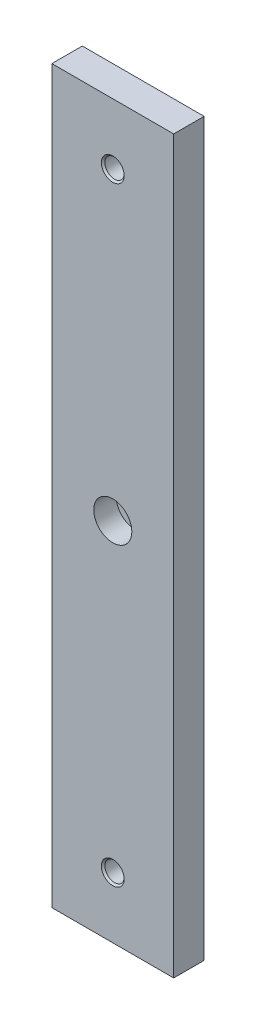
ISO-10303-21;
HEADER;
FILE_DESCRIPTION(('STEP AP214'),'2;1');
FILE_NAME('part.step','',(''),(''),'','','');
FILE_SCHEMA(('AUTOMOTIVE_DESIGN { 1 0 10303 214 1 1 1 1 }'));
ENDSEC;
DATA;
#1=APPLICATION_CONTEXT('core data for automotive mechanical design processes');
#2=APPLICATION_PROTOCOL_DEFINITION('international standard','automotive_design',2000,#1);
#3=PRODUCT_CONTEXT('',#1,'mechanical');
#4=PRODUCT('Part','Part','',(#3));
#5=PRODUCT_RELATED_PRODUCT_CATEGORY('part','',(#4));
#6=PRODUCT_DEFINITION_FORMATION('','',#4);
#7=PRODUCT_DEFINITION_CONTEXT('part definition',#1,'design');
#8=PRODUCT_DEFINITION('design','',#6,#7);
#9=PRODUCT_DEFINITION_SHAPE('','',#8);
#10=(LENGTH_UNIT() NAMED_UNIT(*) SI_UNIT(.MILLI.,.METRE.));
#11=(NAMED_UNIT(*) PLANE_ANGLE_UNIT() SI_UNIT($,.RADIAN.));
#12=(NAMED_UNIT(*) SI_UNIT($,.STERADIAN.) SOLID_ANGLE_UNIT());
#13=UNCERTAINTY_MEASURE_WITH_UNIT(LENGTH_MEASURE(1.E-05),#10,'distance_accuracy_value','');
#14=(GEOMETRIC_REPRESENTATION_CONTEXT(3) GLOBAL_UNCERTAINTY_ASSIGNED_CONTEXT((#13)) GLOBAL_UNIT_ASSIGNED_CONTEXT((#10,
#11,#12)) REPRESENTATION_CONTEXT('',''));
#15=CARTESIAN_POINT('',(0.,0.,0.));
#16=DIRECTION('',(0.,0.,1.));
#17=DIRECTION('',(1.,0.,0.));
#18=AXIS2_PLACEMENT_3D('',#15,#16,#17);
#19=CARTESIAN_POINT('',(-25.4,152.4,6.35));
#20=DIRECTION('',(1.,0.,0.));
#21=DIRECTION('',(0.,1.,0.));
#22=AXIS2_PLACEMENT_3D('',#19,#20,#21);
#23=PLANE('',#22);
#24=DIRECTION('',(0.,-1.,0.));
#25=VECTOR('',#24,1.);
#26=CARTESIAN_POINT('',(-25.4,152.4,-6.35));
#27=LINE('',#26,#25);
#28=CARTESIAN_POINT('',(-25.4,152.4,-6.35));
#29=VERTEX_POINT('',#28);
#30=CARTESIAN_POINT('',(-25.4,-152.4,-6.35));
#31=VERTEX_POINT('',#30);
#32=EDGE_CURVE('E123',#29,#31,#27,.T.);
#33=ORIENTED_EDGE('',*,*,#32,.T.);
#34=DIRECTION('',(0.,0.,-1.));
#35=VECTOR('',#34,1.);
#36=CARTESIAN_POINT('',(-25.4,-152.4,6.35));
#37=LINE('',#36,#35);
#38=CARTESIAN_POINT('',(-25.4,-152.4,6.35));
#39=VERTEX_POINT('',#38);
#40=EDGE_CURVE('E13',#39,#31,#37,.T.);
#41=ORIENTED_EDGE('',*,*,#40,.F.);
#42=DIRECTION('',(0.,-1.,0.));
#43=VECTOR('',#42,1.);
#44=CARTESIAN_POINT('',(-25.4,152.4,6.35));
#45=LINE('',#44,#43);
#46=CARTESIAN_POINT('',(-25.4,152.4,6.35));
#47=VERTEX_POINT('',#46);
#48=EDGE_CURVE('E106',#47,#39,#45,.T.);
#49=ORIENTED_EDGE('',*,*,#48,.F.);
#50=DIRECTION('',(0.,0.,-1.));
#51=VECTOR('',#50,1.);
#52=CARTESIAN_POINT('',(-25.4,152.4,6.35));
#53=LINE('',#52,#51);
#54=EDGE_CURVE('E119',#47,#29,#53,.T.);
#55=ORIENTED_EDGE('',*,*,#54,.T.);
#56=EDGE_LOOP('',(#33,#41,#49,#55));
#57=FACE_BOUND('',#56,.T.);
#58=ADVANCED_FACE('F54',(#57),#23,.F.);
#59=CARTESIAN_POINT('',(-25.4,-152.4,6.35));
#60=DIRECTION('',(0.,1.,0.));
#61=DIRECTION('',(0.,0.,1.));
#62=AXIS2_PLACEMENT_3D('',#59,#60,#61);
#63=PLANE('',#62);
#64=DIRECTION('',(1.,0.,0.));
#65=VECTOR('',#64,1.);
#66=CARTESIAN_POINT('',(-25.4,-152.4,-6.35));
#67=LINE('',#66,#65);
#68=CARTESIAN_POINT('',(25.4,-152.4,-6.35));
#69=VERTEX_POINT('',#68);
#70=EDGE_CURVE('E111',#31,#69,#67,.T.);
#71=ORIENTED_EDGE('',*,*,#70,.T.);
#72=DIRECTION('',(0.,0.,-1.));
#73=VECTOR('',#72,1.);
#74=CARTESIAN_POINT('',(25.4,-152.4,6.35));
#75=LINE('',#74,#73);
#76=CARTESIAN_POINT('',(25.4,-152.4,6.35));
#77=VERTEX_POINT('',#76);
#78=EDGE_CURVE('E63',#77,#69,#75,.T.);
#79=ORIENTED_EDGE('',*,*,#78,.F.);
#80=DIRECTION('',(1.,0.,0.));
#81=VECTOR('',#80,1.);
#82=CARTESIAN_POINT('',(-25.4,-152.4,6.35));
#83=LINE('',#82,#81);
#84=EDGE_CURVE('E101',#39,#77,#83,.T.);
#85=ORIENTED_EDGE('',*,*,#84,.F.);
#86=ORIENTED_EDGE('',*,*,#40,.T.);
#87=EDGE_LOOP('',(#71,#79,#85,#86));
#88=FACE_BOUND('',#87,.T.);
#89=ADVANCED_FACE('F110',(#88),#63,.F.);
#90=CARTESIAN_POINT('',(25.4,152.4,6.35));
#91=DIRECTION('',(-1.,0.,0.));
#92=DIRECTION('',(0.,-1.,0.));
#93=AXIS2_PLACEMENT_3D('',#90,#91,#92);
#94=PLANE('',#93);
#95=DIRECTION('',(0.,1.,0.));
#96=VECTOR('',#95,1.);
#97=CARTESIAN_POINT('',(25.4,152.4,-6.35));
#98=LINE('',#97,#96);
#99=CARTESIAN_POINT('',(25.4,152.4,-6.35));
#100=VERTEX_POINT('',#99);
#101=EDGE_CURVE('E88',#69,#100,#98,.T.);
#102=ORIENTED_EDGE('',*,*,#101,.T.);
#103=DIRECTION('',(0.,0.,-1.));
#104=VECTOR('',#103,1.);
#105=CARTESIAN_POINT('',(25.4,152.4,6.35));
#106=LINE('',#105,#104);
#107=CARTESIAN_POINT('',(25.4,152.4,6.35));
#108=VERTEX_POINT('',#107);
#109=EDGE_CURVE('E113',#108,#100,#106,.T.);
#110=ORIENTED_EDGE('',*,*,#109,.F.);
#111=DIRECTION('',(0.,1.,0.));
#112=VECTOR('',#111,1.);
#113=CARTESIAN_POINT('',(25.4,152.4,6.35));
#114=LINE('',#113,#112);
#115=EDGE_CURVE('E104',#77,#108,#114,.T.);
#116=ORIENTED_EDGE('',*,*,#115,.F.);
#117=ORIENTED_EDGE('',*,*,#78,.T.);
#118=EDGE_LOOP('',(#102,#110,#116,#117));
#119=FACE_BOUND('',#118,.T.);
#120=ADVANCED_FACE('F114',(#119),#94,.F.);
#121=CARTESIAN_POINT('',(-25.4,152.4,6.35));
#122=DIRECTION('',(0.,-1.,0.));
#123=DIRECTION('',(0.,0.,-1.));
#124=AXIS2_PLACEMENT_3D('',#121,#122,#123);
#125=PLANE('',#124);
#126=DIRECTION('',(-1.,0.,0.));
#127=VECTOR('',#126,1.);
#128=CARTESIAN_POINT('',(-25.4,152.4,-6.35));
#129=LINE('',#128,#127);
#130=EDGE_CURVE('E94',#100,#29,#129,.T.);
#131=ORIENTED_EDGE('',*,*,#130,.T.);
#132=ORIENTED_EDGE('',*,*,#54,.F.);
#133=DIRECTION('',(-1.,0.,0.));
#134=VECTOR('',#133,1.);
#135=CARTESIAN_POINT('',(-25.4,152.4,6.35));
#136=LINE('',#135,#134);
#137=EDGE_CURVE('E71',#108,#47,#136,.T.);
#138=ORIENTED_EDGE('',*,*,#137,.F.);
#139=ORIENTED_EDGE('',*,*,#109,.T.);
#140=EDGE_LOOP('',(#131,#132,#138,#139));
#141=FACE_BOUND('',#140,.T.);
#142=ADVANCED_FACE('F137',(#141),#125,.F.);
#143=CARTESIAN_POINT('',(0.,0.,6.35));
#144=DIRECTION('',(0.,0.,1.));
#145=DIRECTION('',(1.,0.,0.));
#146=AXIS2_PLACEMENT_3D('',#143,#144,#145);
#147=PLANE('',#146);
#148=CARTESIAN_POINT('',(0.,0.,6.35));
#149=DIRECTION('',(0.,0.,1.));
#150=DIRECTION('',(1.,0.,0.));
#151=AXIS2_PLACEMENT_3D('',#148,#149,#150);
#152=CIRCLE('',#151,7.9375);
#153=CARTESIAN_POINT('',(7.9375,0.,6.35));
#154=VERTEX_POINT('',#153);
#155=EDGE_CURVE('E176',#154,#154,#152,.T.);
#156=ORIENTED_EDGE('',*,*,#155,.F.);
#157=EDGE_LOOP('',(#156));
#158=FACE_BOUND('',#157,.T.);
#159=CARTESIAN_POINT('',(0.,-127.,6.35));
#160=DIRECTION('',(0.,0.,1.));
#161=DIRECTION('',(1.,0.,0.));
#162=AXIS2_PLACEMENT_3D('',#159,#160,#161);
#163=CIRCLE('',#162,4.7625);
#164=CARTESIAN_POINT('',(4.7625,-127.,6.35));
#165=VERTEX_POINT('',#164);
#166=EDGE_CURVE('E167',#165,#165,#163,.T.);
#167=ORIENTED_EDGE('',*,*,#166,.F.);
#168=EDGE_LOOP('',(#167));
#169=FACE_BOUND('',#168,.T.);
#170=CARTESIAN_POINT('',(0.,127.,6.35));
#171=DIRECTION('',(0.,0.,1.));
#172=DIRECTION('',(1.,0.,0.));
#173=AXIS2_PLACEMENT_3D('',#170,#171,#172);
#174=CIRCLE('',#173,4.7625);
#175=CARTESIAN_POINT('',(4.7625,127.,6.35));
#176=VERTEX_POINT('',#175);
#177=EDGE_CURVE('E152',#176,#176,#174,.T.);
#178=ORIENTED_EDGE('',*,*,#177,.F.);
#179=EDGE_LOOP('',(#178));
#180=FACE_BOUND('',#179,.T.);
#181=ORIENTED_EDGE('',*,*,#48,.T.);
#182=ORIENTED_EDGE('',*,*,#84,.T.);
#183=ORIENTED_EDGE('',*,*,#115,.T.);
#184=ORIENTED_EDGE('',*,*,#137,.T.);
#185=EDGE_LOOP('',(#181,#182,#183,#184));
#186=FACE_BOUND('',#185,.T.);
#187=ADVANCED_FACE('F102',(#158,#169,#180,#186),#147,.T.);
#188=CARTESIAN_POINT('',(0.,0.,-6.35));
#189=DIRECTION('',(0.,0.,1.));
#190=DIRECTION('',(1.,0.,0.));
#191=AXIS2_PLACEMENT_3D('',#188,#189,#190);
#192=PLANE('',#191);
#193=CARTESIAN_POINT('',(0.,-127.,-6.35));
#194=DIRECTION('',(0.,0.,1.));
#195=DIRECTION('',(1.,0.,0.));
#196=AXIS2_PLACEMENT_3D('',#193,#194,#195);
#197=CIRCLE('',#196,4.7625);
#198=CARTESIAN_POINT('',(4.7625,-127.,-6.35));
#199=VERTEX_POINT('',#198);
#200=EDGE_CURVE('E171',#199,#199,#197,.T.);
#201=ORIENTED_EDGE('',*,*,#200,.T.);
#202=EDGE_LOOP('',(#201));
#203=FACE_BOUND('',#202,.T.);
#204=CARTESIAN_POINT('',(0.,127.,-6.35));
#205=DIRECTION('',(0.,0.,1.));
#206=DIRECTION('',(1.,0.,0.));
#207=AXIS2_PLACEMENT_3D('',#204,#205,#206);
#208=CIRCLE('',#207,4.7625);
#209=CARTESIAN_POINT('',(4.7625,127.,-6.35));
#210=VERTEX_POINT('',#209);
#211=EDGE_CURVE('E156',#210,#210,#208,.T.);
#212=ORIENTED_EDGE('',*,*,#211,.T.);
#213=EDGE_LOOP('',(#212));
#214=FACE_BOUND('',#213,.T.);
#215=ORIENTED_EDGE('',*,*,#32,.F.);
#216=ORIENTED_EDGE('',*,*,#130,.F.);
#217=ORIENTED_EDGE('',*,*,#101,.F.);
#218=ORIENTED_EDGE('',*,*,#70,.F.);
#219=EDGE_LOOP('',(#215,#216,#217,#218));
#220=FACE_BOUND('',#219,.T.);
#221=ADVANCED_FACE('F140',(#203,#214,#220),#192,.F.);
#222=CARTESIAN_POINT('',(0.,127.,-5.61975));
#223=DIRECTION('',(0.,0.,-1.));
#224=DIRECTION('',(-1.,0.,0.));
#225=AXIS2_PLACEMENT_3D('',#222,#223,#224);
#226=CONICAL_SURFACE('',#225,4.03225,0.785398163397451);
#227=ORIENTED_EDGE('',*,*,#211,.F.);
#228=EDGE_LOOP('',(#227));
#229=FACE_BOUND('',#228,.T.);
#230=CARTESIAN_POINT('',(0.,127.,-5.61975));
#231=DIRECTION('',(0.,0.,1.));
#232=DIRECTION('',(1.,0.,0.));
#233=AXIS2_PLACEMENT_3D('',#230,#231,#232);
#234=CIRCLE('',#233,4.03225);
#235=CARTESIAN_POINT('',(4.03225,127.,-5.61975));
#236=VERTEX_POINT('',#235);
#237=EDGE_CURVE('E127',#236,#236,#234,.T.);
#238=ORIENTED_EDGE('',*,*,#237,.T.);
#239=EDGE_LOOP('',(#238));
#240=FACE_BOUND('',#239,.T.);
#241=ADVANCED_FACE('F212',(#229,#240),#226,.F.);
#242=CARTESIAN_POINT('',(0.,127.,6.35));
#243=DIRECTION('',(0.,0.,1.));
#244=DIRECTION('',(1.,0.,0.));
#245=AXIS2_PLACEMENT_3D('',#242,#243,#244);
#246=CYLINDRICAL_SURFACE('',#245,4.03225);
#247=ORIENTED_EDGE('',*,*,#237,.F.);
#248=EDGE_LOOP('',(#247));
#249=FACE_BOUND('',#248,.T.);
#250=CARTESIAN_POINT('',(0.,127.,5.61975));
#251=DIRECTION('',(0.,0.,1.));
#252=DIRECTION('',(1.,0.,0.));
#253=AXIS2_PLACEMENT_3D('',#250,#251,#252);
#254=CIRCLE('',#253,4.03225);
#255=CARTESIAN_POINT('',(4.03225,127.,5.61975));
#256=VERTEX_POINT('',#255);
#257=EDGE_CURVE('E149',#256,#256,#254,.T.);
#258=ORIENTED_EDGE('',*,*,#257,.T.);
#259=EDGE_LOOP('',(#258));
#260=FACE_BOUND('',#259,.T.);
#261=ADVANCED_FACE('F202',(#249,#260),#246,.F.);
#262=CARTESIAN_POINT('',(0.,127.,6.35));
#263=DIRECTION('',(0.,0.,1.));
#264=DIRECTION('',(1.,0.,0.));
#265=AXIS2_PLACEMENT_3D('',#262,#263,#264);
#266=CONICAL_SURFACE('',#265,4.7625,0.785398163397451);
#267=ORIENTED_EDGE('',*,*,#257,.F.);
#268=EDGE_LOOP('',(#267));
#269=FACE_BOUND('',#268,.T.);
#270=ORIENTED_EDGE('',*,*,#177,.T.);
#271=EDGE_LOOP('',(#270));
#272=FACE_BOUND('',#271,.T.);
#273=ADVANCED_FACE('F199',(#269,#272),#266,.F.);
#274=CARTESIAN_POINT('',(0.,-127.,-5.61975));
#275=DIRECTION('',(0.,0.,-1.));
#276=DIRECTION('',(-1.,0.,0.));
#277=AXIS2_PLACEMENT_3D('',#274,#275,#276);
#278=CONICAL_SURFACE('',#277,4.03225,0.785398163397451);
#279=ORIENTED_EDGE('',*,*,#200,.F.);
#280=EDGE_LOOP('',(#279));
#281=FACE_BOUND('',#280,.T.);
#282=CARTESIAN_POINT('',(0.,-127.,-5.61975));
#283=DIRECTION('',(0.,0.,1.));
#284=DIRECTION('',(1.,0.,0.));
#285=AXIS2_PLACEMENT_3D('',#282,#283,#284);
#286=CIRCLE('',#285,4.03225);
#287=CARTESIAN_POINT('',(4.03225,-127.,-5.61975));
#288=VERTEX_POINT('',#287);
#289=EDGE_CURVE('E159',#288,#288,#286,.T.);
#290=ORIENTED_EDGE('',*,*,#289,.T.);
#291=EDGE_LOOP('',(#290));
#292=FACE_BOUND('',#291,.T.);
#293=ADVANCED_FACE('F201',(#281,#292),#278,.F.);
#294=CARTESIAN_POINT('',(0.,-127.,6.35));
#295=DIRECTION('',(0.,0.,1.));
#296=DIRECTION('',(1.,0.,0.));
#297=AXIS2_PLACEMENT_3D('',#294,#295,#296);
#298=CYLINDRICAL_SURFACE('',#297,4.03225);
#299=ORIENTED_EDGE('',*,*,#289,.F.);
#300=EDGE_LOOP('',(#299));
#301=FACE_BOUND('',#300,.T.);
#302=CARTESIAN_POINT('',(0.,-127.,5.61975));
#303=DIRECTION('',(0.,0.,1.));
#304=DIRECTION('',(1.,0.,0.));
#305=AXIS2_PLACEMENT_3D('',#302,#303,#304);
#306=CIRCLE('',#305,4.03225);
#307=CARTESIAN_POINT('',(4.03225,-127.,5.61975));
#308=VERTEX_POINT('',#307);
#309=EDGE_CURVE('E163',#308,#308,#306,.T.);
#310=ORIENTED_EDGE('',*,*,#309,.T.);
#311=EDGE_LOOP('',(#310));
#312=FACE_BOUND('',#311,.T.);
#313=ADVANCED_FACE('F209',(#301,#312),#298,.F.);
#314=CARTESIAN_POINT('',(0.,-127.,6.35));
#315=DIRECTION('',(0.,0.,1.));
#316=DIRECTION('',(1.,0.,0.));
#317=AXIS2_PLACEMENT_3D('',#314,#315,#316);
#318=CONICAL_SURFACE('',#317,4.7625,0.785398163397451);
#319=ORIENTED_EDGE('',*,*,#309,.F.);
#320=EDGE_LOOP('',(#319));
#321=FACE_BOUND('',#320,.T.);
#322=ORIENTED_EDGE('',*,*,#166,.T.);
#323=EDGE_LOOP('',(#322));
#324=FACE_BOUND('',#323,.T.);
#325=ADVANCED_FACE('F188',(#321,#324),#318,.F.);
#326=CARTESIAN_POINT('',(0.,0.,-3.048));
#327=DIRECTION('',(0.,0.,1.));
#328=DIRECTION('',(1.,0.,0.));
#329=AXIS2_PLACEMENT_3D('',#326,#327,#328);
#330=CYLINDRICAL_SURFACE('',#329,7.9375);
#331=CARTESIAN_POINT('',(0.,0.,-3.048));
#332=DIRECTION('',(0.,0.,1.));
#333=DIRECTION('',(1.,0.,0.));
#334=AXIS2_PLACEMENT_3D('',#331,#332,#333);
#335=CIRCLE('',#334,7.9375);
#336=CARTESIAN_POINT('',(7.9375,0.,-3.048));
#337=VERTEX_POINT('',#336);
#338=EDGE_CURVE('E175',#337,#337,#335,.T.);
#339=ORIENTED_EDGE('',*,*,#338,.F.);
#340=EDGE_LOOP('',(#339));
#341=FACE_BOUND('',#340,.T.);
#342=ORIENTED_EDGE('',*,*,#155,.T.);
#343=EDGE_LOOP('',(#342));
#344=FACE_BOUND('',#343,.T.);
#345=ADVANCED_FACE('F185',(#341,#344),#330,.F.);
#346=CARTESIAN_POINT('',(0.,0.,-3.048));
#347=DIRECTION('',(0.,0.,1.));
#348=DIRECTION('',(1.,0.,0.));
#349=AXIS2_PLACEMENT_3D('',#346,#347,#348);
#350=PLANE('',#349);
#351=ORIENTED_EDGE('',*,*,#338,.T.);
#352=EDGE_LOOP('',(#351));
#353=FACE_BOUND('',#352,.T.);
#354=ADVANCED_FACE('F183',(#353),#350,.T.);
#355=CLOSED_SHELL('',(#58,#89,#120,#142,#187,#221,#241,#261,#273,#293,#313,#325,#345,#354));
#356=MANIFOLD_SOLID_BREP('B2',#355);
#357=ADVANCED_BREP_SHAPE_REPRESENTATION('',(#18,#356),#14);
#358=SHAPE_DEFINITION_REPRESENTATION(#9,#357);
ENDSEC;
END-ISO-10303-21;
